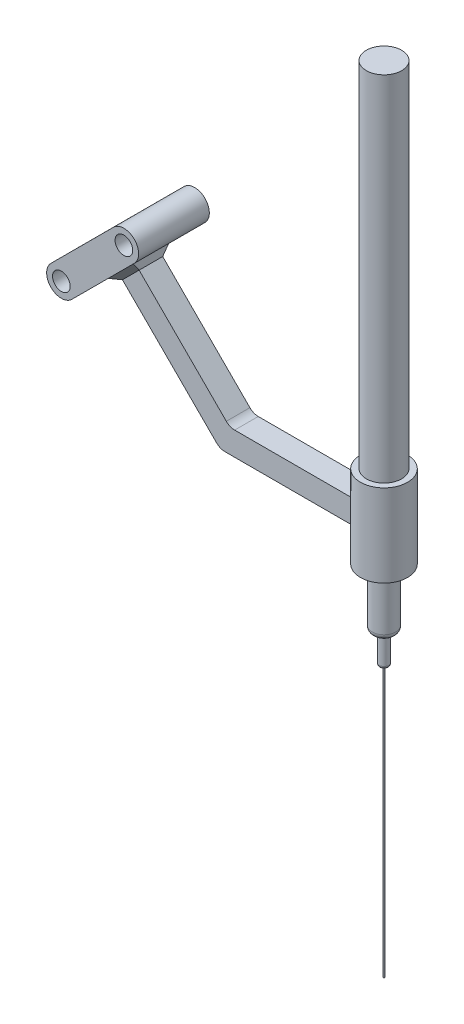
ISO-10303-21;
HEADER;
FILE_DESCRIPTION(('STEP AP214'),'2;1');
FILE_NAME('part.step','',(''),(''),'','','');
FILE_SCHEMA(('AUTOMOTIVE_DESIGN { 1 0 10303 214 1 1 1 1 }'));
ENDSEC;
DATA;
#1=APPLICATION_CONTEXT('core data for automotive mechanical design processes');
#2=APPLICATION_PROTOCOL_DEFINITION('international standard','automotive_design',2000,#1);
#3=PRODUCT_CONTEXT('',#1,'mechanical');
#4=PRODUCT('Part','Part','',(#3));
#5=PRODUCT_RELATED_PRODUCT_CATEGORY('part','',(#4));
#6=PRODUCT_DEFINITION_FORMATION('','',#4);
#7=PRODUCT_DEFINITION_CONTEXT('part definition',#1,'design');
#8=PRODUCT_DEFINITION('design','',#6,#7);
#9=PRODUCT_DEFINITION_SHAPE('','',#8);
#10=(LENGTH_UNIT() NAMED_UNIT(*) SI_UNIT(.MILLI.,.METRE.));
#11=(NAMED_UNIT(*) PLANE_ANGLE_UNIT() SI_UNIT($,.RADIAN.));
#12=(NAMED_UNIT(*) SI_UNIT($,.STERADIAN.) SOLID_ANGLE_UNIT());
#13=UNCERTAINTY_MEASURE_WITH_UNIT(LENGTH_MEASURE(1.E-05),#10,'distance_accuracy_value','');
#14=(GEOMETRIC_REPRESENTATION_CONTEXT(3) GLOBAL_UNCERTAINTY_ASSIGNED_CONTEXT((#13)) GLOBAL_UNIT_ASSIGNED_CONTEXT((#10,
#11,#12)) REPRESENTATION_CONTEXT('',''));
#15=CARTESIAN_POINT('',(0.,0.,0.));
#16=DIRECTION('',(0.,0.,1.));
#17=DIRECTION('',(1.,0.,0.));
#18=AXIS2_PLACEMENT_3D('',#15,#16,#17);
#19=CARTESIAN_POINT('',(84.9348889540142,25.7599169859285,6.));
#20=DIRECTION('',(0.,0.,1.));
#21=DIRECTION('',(0.941950963525003,-0.335750476268192,0.));
#22=AXIS2_PLACEMENT_3D('',#19,#20,#21);
#23=PLANE('',#22);
#24=CARTESIAN_POINT('',(84.9348889540142,25.7599169859285,6.));
#25=DIRECTION('',(0.,0.,1.));
#26=DIRECTION('',(0.941950963525003,-0.335750476268192,0.));
#27=AXIS2_PLACEMENT_3D('',#24,#25,#26);
#28=CIRCLE('',#27,1.5);
#29=CARTESIAN_POINT('',(86.3478153993017,25.2562912715262,6.));
#30=VERTEX_POINT('',#29);
#31=EDGE_CURVE('E201',#30,#30,#28,.T.);
#32=ORIENTED_EDGE('',*,*,#31,.F.);
#33=EDGE_LOOP('',(#32));
#34=FACE_BOUND('',#33,.T.);
#35=CARTESIAN_POINT('',(84.9348889540142,25.7599169859285,6.));
#36=DIRECTION('',(0.,0.,1.));
#37=DIRECTION('',(0.941950963525003,-0.335750476268192,0.));
#38=AXIS2_PLACEMENT_3D('',#35,#36,#37);
#39=CIRCLE('',#38,2.50000000000002);
#40=CARTESIAN_POINT('',(86.7020387322198,23.9915330735984,6.));
#41=VERTEX_POINT('',#40);
#42=CARTESIAN_POINT('',(83.1677391758085,27.5283008982586,6.));
#43=VERTEX_POINT('',#42);
#44=EDGE_CURVE('E207',#41,#43,#39,.T.);
#45=ORIENTED_EDGE('',*,*,#44,.T.);
#46=DIRECTION('',(-0.707353564932031,-0.706859911282248,0.));
#47=VECTOR('',#46,1.);
#48=CARTESIAN_POINT('',(83.1677391758085,27.5283008982586,6.));
#49=LINE('',#48,#47);
#50=CARTESIAN_POINT('',(72.5574357018281,16.9254022290249,6.));
#51=VERTEX_POINT('',#50);
#52=EDGE_CURVE('E210',#43,#51,#49,.T.);
#53=ORIENTED_EDGE('',*,*,#52,.T.);
#54=CARTESIAN_POINT('',(74.3245854800337,15.1570183166948,6.));
#55=DIRECTION('',(0.,0.,1.));
#56=DIRECTION('',(0.941950963525003,-0.335750476268192,0.));
#57=AXIS2_PLACEMENT_3D('',#54,#55,#56);
#58=CIRCLE('',#57,2.50000000000002);
#59=CARTESIAN_POINT('',(76.0917352582394,13.3886344043647,6.));
#60=VERTEX_POINT('',#59);
#61=EDGE_CURVE('E213',#51,#60,#58,.T.);
#62=ORIENTED_EDGE('',*,*,#61,.T.);
#63=DIRECTION('',(0.707353564932031,0.706859911282248,0.));
#64=VECTOR('',#63,1.);
#65=CARTESIAN_POINT('',(86.7020387322198,23.9915330735984,6.));
#66=LINE('',#65,#64);
#67=EDGE_CURVE('E215',#60,#41,#66,.T.);
#68=ORIENTED_EDGE('',*,*,#67,.T.);
#69=EDGE_LOOP('',(#45,#53,#62,#68));
#70=FACE_BOUND('',#69,.T.);
#71=CARTESIAN_POINT('',(74.3245854800337,15.1570183166948,6.));
#72=DIRECTION('',(0.,0.,1.));
#73=DIRECTION('',(0.941950963525003,-0.335750476268192,0.));
#74=AXIS2_PLACEMENT_3D('',#71,#72,#73);
#75=CIRCLE('',#74,1.5);
#76=CARTESIAN_POINT('',(75.7375119253212,14.6533926022925,6.));
#77=VERTEX_POINT('',#76);
#78=EDGE_CURVE('E195',#77,#77,#75,.T.);
#79=ORIENTED_EDGE('',*,*,#78,.F.);
#80=EDGE_LOOP('',(#79));
#81=FACE_BOUND('',#80,.T.);
#82=ADVANCED_FACE('F44',(#34,#70,#81),#23,.T.);
#83=CARTESIAN_POINT('',(84.9348889540142,25.7599169859285,-6.));
#84=DIRECTION('',(0.,0.,1.));
#85=DIRECTION('',(0.941950963525003,-0.335750476268192,0.));
#86=AXIS2_PLACEMENT_3D('',#83,#84,#85);
#87=PLANE('',#86);
#88=CARTESIAN_POINT('',(84.9348889540142,25.7599169859285,-6.));
#89=DIRECTION('',(0.,0.,1.));
#90=DIRECTION('',(0.941950963525003,-0.335750476268192,0.));
#91=AXIS2_PLACEMENT_3D('',#88,#89,#90);
#92=CIRCLE('',#91,2.50000000000002);
#93=CARTESIAN_POINT('',(86.7020387322198,23.9915330735984,-6.));
#94=VERTEX_POINT('',#93);
#95=CARTESIAN_POINT('',(83.1677391758085,27.5283008982586,-6.));
#96=VERTEX_POINT('',#95);
#97=EDGE_CURVE('E204',#94,#96,#92,.T.);
#98=ORIENTED_EDGE('',*,*,#97,.F.);
#99=DIRECTION('',(0.707353564932031,0.706859911282248,0.));
#100=VECTOR('',#99,1.);
#101=CARTESIAN_POINT('',(86.7020387322198,23.9915330735984,-6.));
#102=LINE('',#101,#100);
#103=CARTESIAN_POINT('',(76.0917352582394,13.3886344043647,-6.));
#104=VERTEX_POINT('',#103);
#105=EDGE_CURVE('E211',#104,#94,#102,.T.);
#106=ORIENTED_EDGE('',*,*,#105,.F.);
#107=CARTESIAN_POINT('',(74.3245854800337,15.1570183166948,-6.));
#108=DIRECTION('',(0.,0.,1.));
#109=DIRECTION('',(0.941950963525003,-0.335750476268192,0.));
#110=AXIS2_PLACEMENT_3D('',#107,#108,#109);
#111=CIRCLE('',#110,2.50000000000002);
#112=CARTESIAN_POINT('',(72.5574357018281,16.9254022290249,-6.));
#113=VERTEX_POINT('',#112);
#114=EDGE_CURVE('E222',#113,#104,#111,.T.);
#115=ORIENTED_EDGE('',*,*,#114,.F.);
#116=DIRECTION('',(-0.707353564932031,-0.706859911282248,0.));
#117=VECTOR('',#116,1.);
#118=CARTESIAN_POINT('',(83.1677391758085,27.5283008982586,-6.));
#119=LINE('',#118,#117);
#120=EDGE_CURVE('E220',#96,#113,#119,.T.);
#121=ORIENTED_EDGE('',*,*,#120,.F.);
#122=EDGE_LOOP('',(#98,#106,#115,#121));
#123=FACE_BOUND('',#122,.T.);
#124=CARTESIAN_POINT('',(84.9348889540142,25.7599169859285,-6.));
#125=DIRECTION('',(0.,0.,1.));
#126=DIRECTION('',(0.941950963525003,-0.335750476268192,0.));
#127=AXIS2_PLACEMENT_3D('',#124,#125,#126);
#128=CIRCLE('',#127,1.5);
#129=CARTESIAN_POINT('',(86.3478153993017,25.2562912715262,-6.));
#130=VERTEX_POINT('',#129);
#131=EDGE_CURVE('E198',#130,#130,#128,.T.);
#132=ORIENTED_EDGE('',*,*,#131,.T.);
#133=EDGE_LOOP('',(#132));
#134=FACE_BOUND('',#133,.T.);
#135=CARTESIAN_POINT('',(74.3245854800337,15.1570183166948,-6.));
#136=DIRECTION('',(0.,0.,1.));
#137=DIRECTION('',(0.941950963525003,-0.335750476268192,0.));
#138=AXIS2_PLACEMENT_3D('',#135,#136,#137);
#139=CIRCLE('',#138,1.5);
#140=CARTESIAN_POINT('',(75.7375119253212,14.6533926022925,-6.));
#141=VERTEX_POINT('',#140);
#142=EDGE_CURVE('E194',#141,#141,#139,.T.);
#143=ORIENTED_EDGE('',*,*,#142,.T.);
#144=EDGE_LOOP('',(#143));
#145=FACE_BOUND('',#144,.T.);
#146=ADVANCED_FACE('F346',(#123,#134,#145),#87,.F.);
#147=CARTESIAN_POINT('',(84.9348889540142,25.7599169859285,6.));
#148=DIRECTION('',(0.,0.,-1.));
#149=DIRECTION('',(-0.941950963525003,0.335750476268192,0.));
#150=AXIS2_PLACEMENT_3D('',#147,#148,#149);
#151=CYLINDRICAL_SURFACE('',#150,2.50000000000002);
#152=ORIENTED_EDGE('',*,*,#97,.T.);
#153=DIRECTION('',(0.,0.,-1.));
#154=VECTOR('',#153,1.);
#155=CARTESIAN_POINT('',(83.1677391758085,27.5283008982586,6.));
#156=LINE('',#155,#154);
#157=EDGE_CURVE('E160',#43,#96,#156,.T.);
#158=ORIENTED_EDGE('',*,*,#157,.F.);
#159=ORIENTED_EDGE('',*,*,#44,.F.);
#160=DIRECTION('',(0.,0.,-1.));
#161=VECTOR('',#160,1.);
#162=CARTESIAN_POINT('',(86.7020387322198,23.9915330735984,6.));
#163=LINE('',#162,#161);
#164=EDGE_CURVE('E217',#41,#94,#163,.T.);
#165=ORIENTED_EDGE('',*,*,#164,.T.);
#166=EDGE_LOOP('',(#152,#158,#159,#165));
#167=FACE_BOUND('',#166,.T.);
#168=ADVANCED_FACE('F352',(#167),#151,.T.);
#169=CARTESIAN_POINT('',(83.1677391758085,27.5283008982586,6.));
#170=DIRECTION('',(0.706859911282248,-0.707353564932031,0.));
#171=DIRECTION('',(0.707353564932031,0.706859911282248,0.));
#172=AXIS2_PLACEMENT_3D('',#169,#170,#171);
#173=PLANE('',#172);
#174=ORIENTED_EDGE('',*,*,#120,.T.);
#175=DIRECTION('',(0.,0.,-1.));
#176=VECTOR('',#175,1.);
#177=CARTESIAN_POINT('',(72.5574357018281,16.9254022290249,6.));
#178=LINE('',#177,#176);
#179=EDGE_CURVE('E230',#51,#113,#178,.T.);
#180=ORIENTED_EDGE('',*,*,#179,.F.);
#181=ORIENTED_EDGE('',*,*,#52,.F.);
#182=ORIENTED_EDGE('',*,*,#157,.T.);
#183=EDGE_LOOP('',(#174,#180,#181,#182));
#184=FACE_BOUND('',#183,.T.);
#185=ADVANCED_FACE('F368',(#184),#173,.F.);
#186=CARTESIAN_POINT('',(74.3245854800337,15.1570183166948,6.));
#187=DIRECTION('',(0.,0.,-1.));
#188=DIRECTION('',(-0.941950963525003,0.335750476268192,0.));
#189=AXIS2_PLACEMENT_3D('',#186,#187,#188);
#190=CYLINDRICAL_SURFACE('',#189,2.50000000000002);
#191=ORIENTED_EDGE('',*,*,#114,.T.);
#192=DIRECTION('',(0.,0.,-1.));
#193=VECTOR('',#192,1.);
#194=CARTESIAN_POINT('',(76.0917352582394,13.3886344043647,6.));
#195=LINE('',#194,#193);
#196=EDGE_CURVE('E227',#60,#104,#195,.T.);
#197=ORIENTED_EDGE('',*,*,#196,.F.);
#198=ORIENTED_EDGE('',*,*,#61,.F.);
#199=ORIENTED_EDGE('',*,*,#179,.T.);
#200=EDGE_LOOP('',(#191,#197,#198,#199));
#201=FACE_BOUND('',#200,.T.);
#202=ADVANCED_FACE('F364',(#201),#190,.T.);
#203=CARTESIAN_POINT('',(86.7020387322198,23.9915330735984,6.));
#204=DIRECTION('',(-0.706859911282248,0.707353564932031,0.));
#205=DIRECTION('',(-0.707353564932031,-0.706859911282248,0.));
#206=AXIS2_PLACEMENT_3D('',#203,#204,#205);
#207=PLANE('',#206);
#208=DIRECTION('',(-0.707353564932031,-0.706859911282248,0.));
#209=VECTOR('',#208,1.);
#210=CARTESIAN_POINT('',(79.9821798653655,17.2763639164171,-2.99999999999997));
#211=LINE('',#210,#209);
#212=CARTESIAN_POINT('',(83.5189476900257,20.8106634728283,-2.99999999999997));
#213=VERTEX_POINT('',#212);
#214=CARTESIAN_POINT('',(79.2748263004335,16.5695040051348,-2.99999999999997));
#215=VERTEX_POINT('',#214);
#216=EDGE_CURVE('E253',#213,#215,#211,.T.);
#217=ORIENTED_EDGE('',*,*,#216,.T.);
#218=DIRECTION('',(0.,0.,1.));
#219=VECTOR('',#218,1.);
#220=CARTESIAN_POINT('',(79.2748263004335,16.5695040051348,2.));
#221=LINE('',#220,#219);
#222=CARTESIAN_POINT('',(79.2748263004335,16.5695040051348,2.99999999999997));
#223=VERTEX_POINT('',#222);
#224=EDGE_CURVE('E255',#215,#223,#221,.T.);
#225=ORIENTED_EDGE('',*,*,#224,.T.);
#226=DIRECTION('',(0.707353564932031,0.706859911282248,0.));
#227=VECTOR('',#226,1.);
#228=CARTESIAN_POINT('',(86.7020387322198,23.9915330735984,2.99999999999997));
#229=LINE('',#228,#227);
#230=CARTESIAN_POINT('',(83.5189476900257,20.8106634728283,2.99999999999997));
#231=VERTEX_POINT('',#230);
#232=EDGE_CURVE('E249',#223,#231,#229,.T.);
#233=ORIENTED_EDGE('',*,*,#232,.T.);
#234=DIRECTION('',(0.,0.,-1.));
#235=VECTOR('',#234,1.);
#236=CARTESIAN_POINT('',(83.5189476900257,20.8106634728283,-2.));
#237=LINE('',#236,#235);
#238=EDGE_CURVE('E251',#231,#213,#237,.T.);
#239=ORIENTED_EDGE('',*,*,#238,.T.);
#240=EDGE_LOOP('',(#217,#225,#233,#239));
#241=FACE_BOUND('',#240,.T.);
#242=ORIENTED_EDGE('',*,*,#105,.T.);
#243=ORIENTED_EDGE('',*,*,#164,.F.);
#244=ORIENTED_EDGE('',*,*,#67,.F.);
#245=ORIENTED_EDGE('',*,*,#196,.T.);
#246=EDGE_LOOP('',(#242,#243,#244,#245));
#247=FACE_BOUND('',#246,.T.);
#248=ADVANCED_FACE('F361',(#241,#247),#207,.F.);
#249=CARTESIAN_POINT('',(84.9348889540142,25.7599169859285,6.));
#250=DIRECTION('',(0.,0.,-1.));
#251=DIRECTION('',(-0.941950963525003,0.335750476268192,0.));
#252=AXIS2_PLACEMENT_3D('',#249,#250,#251);
#253=CYLINDRICAL_SURFACE('',#252,1.5);
#254=ORIENTED_EDGE('',*,*,#31,.T.);
#255=EDGE_LOOP('',(#254));
#256=FACE_BOUND('',#255,.T.);
#257=ORIENTED_EDGE('',*,*,#131,.F.);
#258=EDGE_LOOP('',(#257));
#259=FACE_BOUND('',#258,.T.);
#260=ADVANCED_FACE('F358',(#256,#259),#253,.F.);
#261=CARTESIAN_POINT('',(74.3245854800337,15.1570183166948,6.));
#262=DIRECTION('',(0.,0.,-1.));
#263=DIRECTION('',(-0.941950963525003,0.335750476268192,0.));
#264=AXIS2_PLACEMENT_3D('',#261,#262,#263);
#265=CYLINDRICAL_SURFACE('',#264,1.5);
#266=ORIENTED_EDGE('',*,*,#78,.T.);
#267=EDGE_LOOP('',(#266));
#268=FACE_BOUND('',#267,.T.);
#269=ORIENTED_EDGE('',*,*,#142,.F.);
#270=EDGE_LOOP('',(#269));
#271=FACE_BOUND('',#270,.T.);
#272=ADVANCED_FACE('F464',(#268,#271),#265,.F.);
#273=CARTESIAN_POINT('',(82.8115941250937,20.103803561546,2.));
#274=DIRECTION('',(-0.707353564932032,-0.706859911282246,0.));
#275=DIRECTION('',(0.706859911282246,-0.707353564932032,0.));
#276=AXIS2_PLACEMENT_3D('',#273,#274,#275);
#277=PLANE('',#276);
#278=DIRECTION('',(-0.706859911282246,0.707353564932032,0.));
#279=VECTOR('',#278,1.);
#280=CARTESIAN_POINT('',(82.8115941250937,20.103803561546,-2.));
#281=LINE('',#280,#279);
#282=CARTESIAN_POINT('',(98.3182880139787,4.58628017743554,-2.));
#283=VERTEX_POINT('',#282);
#284=CARTESIAN_POINT('',(83.5184540363759,19.396449996614,-2.));
#285=VERTEX_POINT('',#284);
#286=EDGE_CURVE('E302',#283,#285,#281,.T.);
#287=ORIENTED_EDGE('',*,*,#286,.T.);
#288=DIRECTION('',(0.,0.,1.));
#289=VECTOR('',#288,1.);
#290=CARTESIAN_POINT('',(83.5184540363759,19.396449996614,2.));
#291=LINE('',#290,#289);
#292=CARTESIAN_POINT('',(83.5184540363759,19.396449996614,2.));
#293=VERTEX_POINT('',#292);
#294=EDGE_CURVE('E54',#285,#293,#291,.T.);
#295=ORIENTED_EDGE('',*,*,#294,.T.);
#296=DIRECTION('',(-0.706859911282246,0.707353564932032,0.));
#297=VECTOR('',#296,1.);
#298=CARTESIAN_POINT('',(82.8115941250937,20.103803561546,2.));
#299=LINE('',#298,#297);
#300=CARTESIAN_POINT('',(98.3182880139787,4.58628017743554,2.));
#301=VERTEX_POINT('',#300);
#302=EDGE_CURVE('E176',#301,#293,#299,.T.);
#303=ORIENTED_EDGE('',*,*,#302,.F.);
#304=DIRECTION('',(0.,0.,-1.));
#305=VECTOR('',#304,1.);
#306=CARTESIAN_POINT('',(98.3182880139787,4.58628017743554,2.));
#307=LINE('',#306,#305);
#308=EDGE_CURVE('E182',#301,#283,#307,.T.);
#309=ORIENTED_EDGE('',*,*,#308,.T.);
#310=EDGE_LOOP('',(#287,#295,#303,#309));
#311=FACE_BOUND('',#310,.T.);
#312=ADVANCED_FACE('F462',(#311),#277,.F.);
#313=CARTESIAN_POINT('',(79.9821798653655,17.2763639164171,2.));
#314=DIRECTION('',(0.707353564932032,0.706859911282247,0.));
#315=DIRECTION('',(-0.706859911282247,0.707353564932032,0.));
#316=AXIS2_PLACEMENT_3D('',#313,#314,#315);
#317=PLANE('',#316);
#318=DIRECTION('',(0.706859911282247,-0.707353564932032,0.));
#319=VECTOR('',#318,1.);
#320=CARTESIAN_POINT('',(79.9821798653655,17.2763639164171,2.));
#321=LINE('',#320,#319);
#322=CARTESIAN_POINT('',(80.6890397766478,16.5690103514851,2.));
#323=VERTEX_POINT('',#322);
#324=CARTESIAN_POINT('',(96.6606157931796,0.586280177435512,2.));
#325=VERTEX_POINT('',#324);
#326=EDGE_CURVE('E304',#323,#325,#321,.T.);
#327=ORIENTED_EDGE('',*,*,#326,.F.);
#328=DIRECTION('',(0.,0.,-1.));
#329=VECTOR('',#328,1.);
#330=CARTESIAN_POINT('',(80.6890397766477,16.569010351485,-2.));
#331=LINE('',#330,#329);
#332=CARTESIAN_POINT('',(80.6890397766477,16.5690103514851,-2.));
#333=VERTEX_POINT('',#332);
#334=EDGE_CURVE('E246',#323,#333,#331,.T.);
#335=ORIENTED_EDGE('',*,*,#334,.T.);
#336=DIRECTION('',(0.706859911282247,-0.707353564932032,0.));
#337=VECTOR('',#336,1.);
#338=CARTESIAN_POINT('',(79.9821798653655,17.2763639164171,-2.));
#339=LINE('',#338,#337);
#340=CARTESIAN_POINT('',(96.6606157931796,0.586280177435512,-2.));
#341=VERTEX_POINT('',#340);
#342=EDGE_CURVE('E314',#333,#341,#339,.T.);
#343=ORIENTED_EDGE('',*,*,#342,.T.);
#344=DIRECTION('',(0.,0.,-1.));
#345=VECTOR('',#344,1.);
#346=CARTESIAN_POINT('',(96.6606157931796,0.586280177435512,2.));
#347=LINE('',#346,#345);
#348=EDGE_CURVE('E191',#325,#341,#347,.T.);
#349=ORIENTED_EDGE('',*,*,#348,.F.);
#350=EDGE_LOOP('',(#327,#335,#343,#349));
#351=FACE_BOUND('',#350,.T.);
#352=ADVANCED_FACE('F329',(#351),#317,.F.);
#353=CARTESIAN_POINT('',(98.0753229230438,2.00000000000001,2.));
#354=DIRECTION('',(0.,0.,-1.));
#355=DIRECTION('',(-0.941950963525003,0.335750476268192,0.));
#356=AXIS2_PLACEMENT_3D('',#353,#354,#355);
#357=CYLINDRICAL_SURFACE('',#356,2.00000000000005);
#358=CARTESIAN_POINT('',(98.0753229230438,2.00000000000001,-2.));
#359=DIRECTION('',(0.,0.,1.));
#360=DIRECTION('',(0.941950963525003,-0.335750476268192,0.));
#361=AXIS2_PLACEMENT_3D('',#358,#359,#360);
#362=CIRCLE('',#361,2.00000000000005);
#363=CARTESIAN_POINT('',(98.0753229230437,0.,-2.));
#364=VERTEX_POINT('',#363);
#365=EDGE_CURVE('E178',#341,#364,#362,.T.);
#366=ORIENTED_EDGE('',*,*,#365,.T.);
#367=DIRECTION('',(0.,0.,-1.));
#368=VECTOR('',#367,1.);
#369=CARTESIAN_POINT('',(98.0753229230437,0.,2.));
#370=LINE('',#369,#368);
#371=CARTESIAN_POINT('',(98.0753229230437,0.,2.));
#372=VERTEX_POINT('',#371);
#373=EDGE_CURVE('E188',#372,#364,#370,.T.);
#374=ORIENTED_EDGE('',*,*,#373,.F.);
#375=CARTESIAN_POINT('',(98.0753229230438,2.00000000000001,2.));
#376=DIRECTION('',(0.,0.,1.));
#377=DIRECTION('',(0.941950963525003,-0.335750476268192,0.));
#378=AXIS2_PLACEMENT_3D('',#375,#376,#377);
#379=CIRCLE('',#378,2.00000000000005);
#380=EDGE_CURVE('E306',#325,#372,#379,.T.);
#381=ORIENTED_EDGE('',*,*,#380,.F.);
#382=ORIENTED_EDGE('',*,*,#348,.T.);
#383=EDGE_LOOP('',(#366,#374,#381,#382));
#384=FACE_BOUND('',#383,.T.);
#385=ADVANCED_FACE('F318',(#384),#357,.T.);
#386=CARTESIAN_POINT('',(123.075322923044,0.,2.));
#387=DIRECTION('',(0.,1.,0.));
#388=DIRECTION('',(-1.,0.,0.));
#389=AXIS2_PLACEMENT_3D('',#386,#387,#388);
#390=PLANE('',#389);
#391=DIRECTION('',(1.,0.,0.));
#392=VECTOR('',#391,1.);
#393=CARTESIAN_POINT('',(123.075322923044,0.,-2.));
#394=LINE('',#393,#392);
#395=CARTESIAN_POINT('',(119.611221307906,0.,-2.));
#396=VERTEX_POINT('',#395);
#397=EDGE_CURVE('E174',#364,#396,#394,.T.);
#398=ORIENTED_EDGE('',*,*,#397,.T.);
#399=CARTESIAN_POINT('',(123.075322923044,0.,0.));
#400=DIRECTION('',(0.,1.,0.));
#401=DIRECTION('',(-1.,0.,0.));
#402=AXIS2_PLACEMENT_3D('',#399,#400,#401);
#403=CIRCLE('',#402,3.99999999999996);
#404=CARTESIAN_POINT('',(119.611221307906,0.,2.));
#405=VERTEX_POINT('',#404);
#406=EDGE_CURVE('E155',#396,#405,#403,.T.);
#407=ORIENTED_EDGE('',*,*,#406,.T.);
#408=DIRECTION('',(1.,0.,0.));
#409=VECTOR('',#408,1.);
#410=CARTESIAN_POINT('',(123.075322923044,0.,2.));
#411=LINE('',#410,#409);
#412=EDGE_CURVE('E308',#372,#405,#411,.T.);
#413=ORIENTED_EDGE('',*,*,#412,.F.);
#414=ORIENTED_EDGE('',*,*,#373,.T.);
#415=EDGE_LOOP('',(#398,#407,#413,#414));
#416=FACE_BOUND('',#415,.T.);
#417=ADVANCED_FACE('F323',(#416),#390,.F.);
#418=CARTESIAN_POINT('',(123.075322923044,4.00000000000001,2.));
#419=DIRECTION('',(0.,-1.,0.));
#420=DIRECTION('',(1.,0.,0.));
#421=AXIS2_PLACEMENT_3D('',#418,#419,#420);
#422=PLANE('',#421);
#423=DIRECTION('',(-1.,0.,0.));
#424=VECTOR('',#423,1.);
#425=CARTESIAN_POINT('',(123.075322923044,4.00000000000001,2.));
#426=LINE('',#425,#424);
#427=CARTESIAN_POINT('',(119.611221307906,4.00000000000001,2.));
#428=VERTEX_POINT('',#427);
#429=CARTESIAN_POINT('',(99.7329951438427,4.,2.));
#430=VERTEX_POINT('',#429);
#431=EDGE_CURVE('E168',#428,#430,#426,.T.);
#432=ORIENTED_EDGE('',*,*,#431,.F.);
#433=CARTESIAN_POINT('',(123.075322923044,4.00000000000001,0.));
#434=DIRECTION('',(0.,-1.,0.));
#435=DIRECTION('',(1.,0.,0.));
#436=AXIS2_PLACEMENT_3D('',#433,#434,#435);
#437=CIRCLE('',#436,3.99999999999996);
#438=CARTESIAN_POINT('',(119.611221307906,4.00000000000001,-2.));
#439=VERTEX_POINT('',#438);
#440=EDGE_CURVE('E152',#428,#439,#437,.T.);
#441=ORIENTED_EDGE('',*,*,#440,.T.);
#442=DIRECTION('',(-1.,0.,0.));
#443=VECTOR('',#442,1.);
#444=CARTESIAN_POINT('',(123.075322923044,4.00000000000001,-2.));
#445=LINE('',#444,#443);
#446=CARTESIAN_POINT('',(99.7329951438427,4.,-2.));
#447=VERTEX_POINT('',#446);
#448=EDGE_CURVE('E166',#439,#447,#445,.T.);
#449=ORIENTED_EDGE('',*,*,#448,.T.);
#450=DIRECTION('',(0.,0.,-1.));
#451=VECTOR('',#450,1.);
#452=CARTESIAN_POINT('',(99.7329951438427,4.,2.));
#453=LINE('',#452,#451);
#454=EDGE_CURVE('E185',#430,#447,#453,.T.);
#455=ORIENTED_EDGE('',*,*,#454,.F.);
#456=EDGE_LOOP('',(#432,#441,#449,#455));
#457=FACE_BOUND('',#456,.T.);
#458=ADVANCED_FACE('F164',(#457),#422,.F.);
#459=CARTESIAN_POINT('',(99.7329951438428,6.00000000000001,2.));
#460=DIRECTION('',(0.,0.,-1.));
#461=DIRECTION('',(-0.941950963525003,0.335750476268192,0.));
#462=AXIS2_PLACEMENT_3D('',#459,#460,#461);
#463=CYLINDRICAL_SURFACE('',#462,2.00000000000005);
#464=CARTESIAN_POINT('',(99.7329951438428,6.00000000000001,-2.));
#465=DIRECTION('',(0.,0.,-1.));
#466=DIRECTION('',(0.941950963525003,-0.335750476268192,0.));
#467=AXIS2_PLACEMENT_3D('',#464,#465,#466);
#468=CIRCLE('',#467,2.00000000000005);
#469=EDGE_CURVE('E173',#447,#283,#468,.T.);
#470=ORIENTED_EDGE('',*,*,#469,.T.);
#471=ORIENTED_EDGE('',*,*,#308,.F.);
#472=CARTESIAN_POINT('',(99.7329951438428,6.00000000000001,2.));
#473=DIRECTION('',(0.,0.,-1.));
#474=DIRECTION('',(0.941950963525003,-0.335750476268192,0.));
#475=AXIS2_PLACEMENT_3D('',#472,#473,#474);
#476=CIRCLE('',#475,2.00000000000005);
#477=EDGE_CURVE('E186',#430,#301,#476,.T.);
#478=ORIENTED_EDGE('',*,*,#477,.F.);
#479=ORIENTED_EDGE('',*,*,#454,.T.);
#480=EDGE_LOOP('',(#470,#471,#478,#479));
#481=FACE_BOUND('',#480,.T.);
#482=ADVANCED_FACE('F448',(#481),#463,.F.);
#483=CARTESIAN_POINT('',(99.7329951438428,6.00000000000001,2.));
#484=DIRECTION('',(0.,0.,1.));
#485=DIRECTION('',(0.941950963525003,-0.335750476268192,0.));
#486=AXIS2_PLACEMENT_3D('',#483,#484,#485);
#487=PLANE('',#486);
#488=ORIENTED_EDGE('',*,*,#302,.T.);
#489=DIRECTION('',(-0.707353564932031,-0.706859911282248,0.));
#490=VECTOR('',#489,1.);
#491=CARTESIAN_POINT('',(84.93316116624,20.8101698191786,2.));
#492=LINE('',#491,#490);
#493=EDGE_CURVE('E12',#293,#323,#492,.T.);
#494=ORIENTED_EDGE('',*,*,#493,.T.);
#495=ORIENTED_EDGE('',*,*,#326,.T.);
#496=ORIENTED_EDGE('',*,*,#380,.T.);
#497=ORIENTED_EDGE('',*,*,#412,.T.);
#498=DIRECTION('',(0.,1.,0.));
#499=VECTOR('',#498,1.);
#500=CARTESIAN_POINT('',(119.611221307906,-21.3137084989847,2.));
#501=LINE('',#500,#499);
#502=EDGE_CURVE('E300',#428,#405,#501,.F.);
#503=ORIENTED_EDGE('',*,*,#502,.F.);
#504=ORIENTED_EDGE('',*,*,#431,.T.);
#505=ORIENTED_EDGE('',*,*,#477,.T.);
#506=EDGE_LOOP('',(#488,#494,#495,#496,#497,#503,#504,#505));
#507=FACE_BOUND('',#506,.T.);
#508=ADVANCED_FACE('F325',(#507),#487,.T.);
#509=CARTESIAN_POINT('',(99.7329951438428,6.00000000000001,-2.));
#510=DIRECTION('',(0.,0.,1.));
#511=DIRECTION('',(0.941950963525003,-0.335750476268192,0.));
#512=AXIS2_PLACEMENT_3D('',#509,#510,#511);
#513=PLANE('',#512);
#514=ORIENTED_EDGE('',*,*,#342,.F.);
#515=DIRECTION('',(0.707353564932031,0.706859911282248,0.));
#516=VECTOR('',#515,1.);
#517=CARTESIAN_POINT('',(83.5184540363759,19.3964499966141,-2.));
#518=LINE('',#517,#516);
#519=EDGE_CURVE('E69',#333,#285,#518,.T.);
#520=ORIENTED_EDGE('',*,*,#519,.T.);
#521=ORIENTED_EDGE('',*,*,#286,.F.);
#522=ORIENTED_EDGE('',*,*,#469,.F.);
#523=ORIENTED_EDGE('',*,*,#448,.F.);
#524=DIRECTION('',(0.,1.,0.));
#525=VECTOR('',#524,1.);
#526=CARTESIAN_POINT('',(119.611221307906,-21.3137084989847,-2.));
#527=LINE('',#526,#525);
#528=EDGE_CURVE('E148',#439,#396,#527,.F.);
#529=ORIENTED_EDGE('',*,*,#528,.T.);
#530=ORIENTED_EDGE('',*,*,#397,.F.);
#531=ORIENTED_EDGE('',*,*,#365,.F.);
#532=EDGE_LOOP('',(#514,#520,#521,#522,#523,#529,#530,#531));
#533=FACE_BOUND('',#532,.T.);
#534=ADVANCED_FACE('F172',(#533),#513,.F.);
#535=CARTESIAN_POINT('',(123.075322923044,-21.3137084989847,0.));
#536=DIRECTION('',(0.,1.,0.));
#537=DIRECTION('',(-1.,0.,0.));
#538=AXIS2_PLACEMENT_3D('',#535,#536,#537);
#539=CYLINDRICAL_SURFACE('',#538,3.99999999999996);
#540=ORIENTED_EDGE('',*,*,#440,.F.);
#541=ORIENTED_EDGE('',*,*,#502,.T.);
#542=ORIENTED_EDGE('',*,*,#406,.F.);
#543=ORIENTED_EDGE('',*,*,#528,.F.);
#544=EDGE_LOOP('',(#540,#541,#542,#543));
#545=FACE_BOUND('',#544,.T.);
#546=CARTESIAN_POINT('',(123.075322923044,-5.,0.));
#547=DIRECTION('',(0.,1.,0.));
#548=DIRECTION('',(-1.,0.,0.));
#549=AXIS2_PLACEMENT_3D('',#546,#547,#548);
#550=CIRCLE('',#549,3.99999999999996);
#551=CARTESIAN_POINT('',(119.075322923044,-5.,0.));
#552=VERTEX_POINT('',#551);
#553=EDGE_CURVE('E169',#552,#552,#550,.F.);
#554=ORIENTED_EDGE('',*,*,#553,.F.);
#555=EDGE_LOOP('',(#554));
#556=FACE_BOUND('',#555,.T.);
#557=CARTESIAN_POINT('',(123.075322923044,8.99999999999995,0.));
#558=DIRECTION('',(0.,1.,0.));
#559=DIRECTION('',(-1.,0.,0.));
#560=AXIS2_PLACEMENT_3D('',#557,#558,#559);
#561=CIRCLE('',#560,3.99999999999996);
#562=CARTESIAN_POINT('',(119.075322923044,8.99999999999995,0.));
#563=VERTEX_POINT('',#562);
#564=EDGE_CURVE('E294',#563,#563,#561,.T.);
#565=ORIENTED_EDGE('',*,*,#564,.F.);
#566=EDGE_LOOP('',(#565));
#567=FACE_BOUND('',#566,.T.);
#568=ADVANCED_FACE('F150',(#545,#556,#567),#539,.T.);
#569=CARTESIAN_POINT('',(123.075322923044,-5.,2.));
#570=DIRECTION('',(0.,1.,0.));
#571=DIRECTION('',(-1.,0.,0.));
#572=AXIS2_PLACEMENT_3D('',#569,#570,#571);
#573=PLANE('',#572);
#574=ORIENTED_EDGE('',*,*,#553,.T.);
#575=EDGE_LOOP('',(#574));
#576=FACE_BOUND('',#575,.T.);
#577=CARTESIAN_POINT('',(123.075322923044,-5.00000000000002,0.));
#578=DIRECTION('',(0.,1.,0.));
#579=DIRECTION('',(-1.,0.,0.));
#580=AXIS2_PLACEMENT_3D('',#577,#578,#579);
#581=CIRCLE('',#580,2.00000000000001);
#582=CARTESIAN_POINT('',(121.075322923044,-5.00000000000002,0.));
#583=VERTEX_POINT('',#582);
#584=EDGE_CURVE('E280',#583,#583,#581,.T.);
#585=ORIENTED_EDGE('',*,*,#584,.T.);
#586=EDGE_LOOP('',(#585));
#587=FACE_BOUND('',#586,.T.);
#588=ADVANCED_FACE('F439',(#576,#587),#573,.F.);
#589=CARTESIAN_POINT('',(123.075322923044,8.99999999999995,0.));
#590=DIRECTION('',(0.,1.,0.));
#591=DIRECTION('',(-1.,0.,0.));
#592=AXIS2_PLACEMENT_3D('',#589,#590,#591);
#593=PLANE('',#592);
#594=ORIENTED_EDGE('',*,*,#564,.T.);
#595=EDGE_LOOP('',(#594));
#596=FACE_BOUND('',#595,.T.);
#597=CARTESIAN_POINT('',(123.075322923044,8.99999999999995,0.));
#598=DIRECTION('',(0.,1.,0.));
#599=DIRECTION('',(-1.,0.,0.));
#600=AXIS2_PLACEMENT_3D('',#597,#598,#599);
#601=CIRCLE('',#600,3.00000000000001);
#602=CARTESIAN_POINT('',(120.075322923044,8.99999999999995,0.));
#603=VERTEX_POINT('',#602);
#604=EDGE_CURVE('E291',#603,#603,#601,.T.);
#605=ORIENTED_EDGE('',*,*,#604,.F.);
#606=EDGE_LOOP('',(#605));
#607=FACE_BOUND('',#606,.T.);
#608=ADVANCED_FACE('F429',(#596,#607),#593,.T.);
#609=CARTESIAN_POINT('',(120.075322923044,69.,0.));
#610=DIRECTION('',(0.,1.,0.));
#611=DIRECTION('',(-1.,0.,0.));
#612=AXIS2_PLACEMENT_3D('',#609,#610,#611);
#613=PLANE('',#612);
#614=CARTESIAN_POINT('',(123.075322923044,69.,0.));
#615=DIRECTION('',(0.,1.,0.));
#616=DIRECTION('',(-1.,0.,0.));
#617=AXIS2_PLACEMENT_3D('',#614,#615,#616);
#618=CIRCLE('',#617,2.99999999999998);
#619=CARTESIAN_POINT('',(120.075322923044,69.,0.));
#620=VERTEX_POINT('',#619);
#621=EDGE_CURVE('E285',#620,#620,#618,.T.);
#622=ORIENTED_EDGE('',*,*,#621,.T.);
#623=EDGE_LOOP('',(#622));
#624=FACE_BOUND('',#623,.T.);
#625=ADVANCED_FACE('F425',(#624),#613,.T.);
#626=CARTESIAN_POINT('',(123.075322923044,69.,0.));
#627=DIRECTION('',(0.,1.,0.));
#628=DIRECTION('',(-1.,0.,0.));
#629=AXIS2_PLACEMENT_3D('',#626,#627,#628);
#630=CYLINDRICAL_SURFACE('',#629,2.99999999999999);
#631=ORIENTED_EDGE('',*,*,#604,.T.);
#632=EDGE_LOOP('',(#631));
#633=FACE_BOUND('',#632,.T.);
#634=ORIENTED_EDGE('',*,*,#621,.F.);
#635=EDGE_LOOP('',(#634));
#636=FACE_BOUND('',#635,.T.);
#637=ADVANCED_FACE('F421',(#633,#636),#630,.T.);
#638=CARTESIAN_POINT('',(123.075322923044,69.,0.));
#639=DIRECTION('',(0.,1.,0.));
#640=DIRECTION('',(-1.,0.,0.));
#641=AXIS2_PLACEMENT_3D('',#638,#639,#640);
#642=CYLINDRICAL_SURFACE('',#641,0.100000000000016);
#643=CARTESIAN_POINT('',(123.075322923044,-65.785712664924,0.));
#644=DIRECTION('',(0.,1.,0.));
#645=DIRECTION('',(-1.,0.,0.));
#646=AXIS2_PLACEMENT_3D('',#643,#644,#645);
#647=CIRCLE('',#646,0.100000000000017);
#648=CARTESIAN_POINT('',(122.975322923044,-65.785712664924,0.));
#649=VERTEX_POINT('',#648);
#650=EDGE_CURVE('E288',#649,#649,#647,.T.);
#651=ORIENTED_EDGE('',*,*,#650,.T.);
#652=EDGE_LOOP('',(#651));
#653=FACE_BOUND('',#652,.T.);
#654=CARTESIAN_POINT('',(123.075322923044,-20.,0.));
#655=DIRECTION('',(0.,1.,0.));
#656=DIRECTION('',(-1.,0.,0.));
#657=AXIS2_PLACEMENT_3D('',#654,#655,#656);
#658=CIRCLE('',#657,0.10000000000002);
#659=CARTESIAN_POINT('',(122.975322923044,-20.,0.));
#660=VERTEX_POINT('',#659);
#661=EDGE_CURVE('E269',#660,#660,#658,.T.);
#662=ORIENTED_EDGE('',*,*,#661,.F.);
#663=EDGE_LOOP('',(#662));
#664=FACE_BOUND('',#663,.T.);
#665=ADVANCED_FACE('F424',(#653,#664),#642,.T.);
#666=CARTESIAN_POINT('',(122.975322923044,-65.785712664924,0.));
#667=DIRECTION('',(0.,-1.,0.));
#668=DIRECTION('',(1.,0.,0.));
#669=AXIS2_PLACEMENT_3D('',#666,#667,#668);
#670=PLANE('',#669);
#671=ORIENTED_EDGE('',*,*,#650,.F.);
#672=EDGE_LOOP('',(#671));
#673=FACE_BOUND('',#672,.T.);
#674=ADVANCED_FACE('F416',(#673),#670,.T.);
#675=CARTESIAN_POINT('',(123.075322923044,69.,0.));
#676=DIRECTION('',(0.,1.,0.));
#677=DIRECTION('',(-1.,0.,0.));
#678=AXIS2_PLACEMENT_3D('',#675,#676,#677);
#679=CYLINDRICAL_SURFACE('',#678,2.);
#680=CARTESIAN_POINT('',(123.075322923044,-14.,0.));
#681=DIRECTION('',(0.,-1.,0.));
#682=DIRECTION('',(1.,0.,0.));
#683=AXIS2_PLACEMENT_3D('',#680,#681,#682);
#684=CIRCLE('',#683,2.);
#685=CARTESIAN_POINT('',(125.075322923044,-14.,0.));
#686=VERTEX_POINT('',#685);
#687=EDGE_CURVE('E159',#686,#686,#684,.F.);
#688=ORIENTED_EDGE('',*,*,#687,.T.);
#689=EDGE_LOOP('',(#688));
#690=FACE_BOUND('',#689,.T.);
#691=ORIENTED_EDGE('',*,*,#584,.F.);
#692=EDGE_LOOP('',(#691));
#693=FACE_BOUND('',#692,.T.);
#694=ADVANCED_FACE('F410',(#690,#693),#679,.T.);
#695=CARTESIAN_POINT('',(121.075322923044,-15.,0.));
#696=DIRECTION('',(0.,-1.,0.));
#697=DIRECTION('',(1.,0.,0.));
#698=AXIS2_PLACEMENT_3D('',#695,#696,#697);
#699=PLANE('',#698);
#700=CARTESIAN_POINT('',(123.075322923044,-15.,0.));
#701=DIRECTION('',(0.,-1.,0.));
#702=DIRECTION('',(1.,0.,0.));
#703=AXIS2_PLACEMENT_3D('',#700,#701,#702);
#704=CIRCLE('',#703,1.);
#705=CARTESIAN_POINT('',(124.075322923044,-15.,0.));
#706=VERTEX_POINT('',#705);
#707=EDGE_CURVE('E237',#706,#706,#704,.T.);
#708=ORIENTED_EDGE('',*,*,#707,.T.);
#709=EDGE_LOOP('',(#708));
#710=FACE_BOUND('',#709,.T.);
#711=CARTESIAN_POINT('',(123.075322923044,-15.,0.));
#712=DIRECTION('',(0.,1.,0.));
#713=DIRECTION('',(-1.,0.,0.));
#714=AXIS2_PLACEMENT_3D('',#711,#712,#713);
#715=CIRCLE('',#714,0.800000000000023);
#716=CARTESIAN_POINT('',(122.275322923044,-15.,0.));
#717=VERTEX_POINT('',#716);
#718=EDGE_CURVE('E275',#717,#717,#715,.T.);
#719=ORIENTED_EDGE('',*,*,#718,.T.);
#720=EDGE_LOOP('',(#719));
#721=FACE_BOUND('',#720,.T.);
#722=ADVANCED_FACE('F405',(#710,#721),#699,.T.);
#723=CARTESIAN_POINT('',(123.075322923044,69.,0.));
#724=DIRECTION('',(0.,1.,0.));
#725=DIRECTION('',(-1.,0.,0.));
#726=AXIS2_PLACEMENT_3D('',#723,#724,#725);
#727=CYLINDRICAL_SURFACE('',#726,0.800000000000025);
#728=CARTESIAN_POINT('',(123.075322923044,-19.5,0.));
#729=DIRECTION('',(0.,-1.,0.));
#730=DIRECTION('',(1.,0.,0.));
#731=AXIS2_PLACEMENT_3D('',#728,#729,#730);
#732=CIRCLE('',#731,0.800000000000025);
#733=CARTESIAN_POINT('',(123.875322923044,-19.5,0.));
#734=VERTEX_POINT('',#733);
#735=EDGE_CURVE('E240',#734,#734,#732,.F.);
#736=ORIENTED_EDGE('',*,*,#735,.T.);
#737=EDGE_LOOP('',(#736));
#738=FACE_BOUND('',#737,.T.);
#739=ORIENTED_EDGE('',*,*,#718,.F.);
#740=EDGE_LOOP('',(#739));
#741=FACE_BOUND('',#740,.T.);
#742=ADVANCED_FACE('F402',(#738,#741),#727,.T.);
#743=CARTESIAN_POINT('',(122.275322923044,-20.,0.));
#744=DIRECTION('',(0.,-1.,0.));
#745=DIRECTION('',(1.,0.,0.));
#746=AXIS2_PLACEMENT_3D('',#743,#744,#745);
#747=PLANE('',#746);
#748=CARTESIAN_POINT('',(123.075322923044,-20.,0.));
#749=DIRECTION('',(0.,-1.,0.));
#750=DIRECTION('',(1.,0.,0.));
#751=AXIS2_PLACEMENT_3D('',#748,#749,#750);
#752=CIRCLE('',#751,0.300000000000026);
#753=CARTESIAN_POINT('',(123.375322923044,-20.,0.));
#754=VERTEX_POINT('',#753);
#755=EDGE_CURVE('E243',#754,#754,#752,.T.);
#756=ORIENTED_EDGE('',*,*,#755,.T.);
#757=EDGE_LOOP('',(#756));
#758=FACE_BOUND('',#757,.T.);
#759=ORIENTED_EDGE('',*,*,#661,.T.);
#760=EDGE_LOOP('',(#759));
#761=FACE_BOUND('',#760,.T.);
#762=ADVANCED_FACE('F380',(#758,#761),#747,.T.);
#763=CARTESIAN_POINT('',(123.075322923044,-14.,0.));
#764=DIRECTION('',(0.,-1.,0.));
#765=DIRECTION('',(1.,0.,0.));
#766=AXIS2_PLACEMENT_3D('',#763,#764,#765);
#767=DEGENERATE_TOROIDAL_SURFACE('',#766,1.,1.,.T.);
#768=ORIENTED_EDGE('',*,*,#707,.F.);
#769=EDGE_LOOP('',(#768));
#770=FACE_BOUND('',#769,.T.);
#771=ORIENTED_EDGE('',*,*,#687,.F.);
#772=EDGE_LOOP('',(#771));
#773=FACE_BOUND('',#772,.T.);
#774=ADVANCED_FACE('F376',(#770,#773),#767,.T.);
#775=CARTESIAN_POINT('',(123.075322923044,-19.5,0.));
#776=DIRECTION('',(0.,-1.,0.));
#777=DIRECTION('',(1.,0.,0.));
#778=AXIS2_PLACEMENT_3D('',#775,#776,#777);
#779=DEGENERATE_TOROIDAL_SURFACE('',#778,0.300000000000026,0.5,.T.);
#780=ORIENTED_EDGE('',*,*,#755,.F.);
#781=EDGE_LOOP('',(#780));
#782=FACE_BOUND('',#781,.T.);
#783=ORIENTED_EDGE('',*,*,#735,.F.);
#784=EDGE_LOOP('',(#783));
#785=FACE_BOUND('',#784,.T.);
#786=ADVANCED_FACE('F379',(#782,#785),#779,.T.);
#787=CARTESIAN_POINT('',(83.5189476900257,20.8106634728283,6.));
#788=DIRECTION('',(0.999999939076517,-0.000349065843319951,0.));
#789=DIRECTION('',(0.,0.,1.));
#790=AXIS2_PLACEMENT_3D('',#787,#788,#789);
#791=PLANE('',#790);
#792=DIRECTION('',(0.000285011067589365,0.816496531183908,-0.577350269189629));
#793=VECTOR('',#792,1.);
#794=CARTESIAN_POINT('',(83.5174667290763,16.5680230441854,0.));
#795=LINE('',#794,#793);
#796=EDGE_CURVE('E263',#213,#285,#795,.F.);
#797=ORIENTED_EDGE('',*,*,#796,.F.);
#798=ORIENTED_EDGE('',*,*,#238,.F.);
#799=DIRECTION('',(-0.000285011067589396,-0.816496531183908,-0.577350269189629));
#800=VECTOR('',#799,1.);
#801=CARTESIAN_POINT('',(83.5187831388091,20.3392589807569,2.66666666666668));
#802=LINE('',#801,#800);
#803=EDGE_CURVE('E49',#293,#231,#802,.F.);
#804=ORIENTED_EDGE('',*,*,#803,.F.);
#805=ORIENTED_EDGE('',*,*,#294,.F.);
#806=EDGE_LOOP('',(#797,#798,#804,#805));
#807=FACE_BOUND('',#806,.T.);
#808=ADVANCED_FACE('F47',(#807),#791,.T.);
#809=CARTESIAN_POINT('',(84.93316116624,20.8101698191786,2.));
#810=DIRECTION('',(-0.499825436616601,0.500174502459921,-0.707106781186544));
#811=DIRECTION('',(-0.707353564932031,-0.706859911282248,0.));
#812=AXIS2_PLACEMENT_3D('',#809,#810,#811);
#813=PLANE('',#812);
#814=ORIENTED_EDGE('',*,*,#803,.T.);
#815=ORIENTED_EDGE('',*,*,#232,.F.);
#816=DIRECTION('',(-0.816496531183907,0.000285011067590118,0.57735026918963));
#817=VECTOR('',#816,1.);
#818=CARTESIAN_POINT('',(83.5174667290763,16.5680230441855,0.));
#819=LINE('',#818,#817);
#820=EDGE_CURVE('E262',#323,#223,#819,.T.);
#821=ORIENTED_EDGE('',*,*,#820,.F.);
#822=ORIENTED_EDGE('',*,*,#493,.F.);
#823=EDGE_LOOP('',(#814,#815,#821,#822));
#824=FACE_BOUND('',#823,.T.);
#825=ADVANCED_FACE('F337',(#824),#813,.F.);
#826=CARTESIAN_POINT('',(86.7020387322198,23.9915330735984,-2.99999999999997));
#827=DIRECTION('',(0.499825436616601,-0.500174502459921,-0.707106781186544));
#828=DIRECTION('',(0.707353564932031,0.706859911282248,0.));
#829=AXIS2_PLACEMENT_3D('',#826,#827,#828);
#830=PLANE('',#829);
#831=ORIENTED_EDGE('',*,*,#796,.T.);
#832=ORIENTED_EDGE('',*,*,#519,.F.);
#833=DIRECTION('',(-0.816496531183907,0.000285011067590086,-0.57735026918963));
#834=VECTOR('',#833,1.);
#835=CARTESIAN_POINT('',(84.2245734671834,16.5677762173606,0.500000000000028));
#836=LINE('',#835,#834);
#837=EDGE_CURVE('E260',#215,#333,#836,.F.);
#838=ORIENTED_EDGE('',*,*,#837,.F.);
#839=ORIENTED_EDGE('',*,*,#216,.F.);
#840=EDGE_LOOP('',(#831,#832,#838,#839));
#841=FACE_BOUND('',#840,.T.);
#842=ADVANCED_FACE('F335',(#841),#830,.T.);
#843=CARTESIAN_POINT('',(80.6890397766478,16.569010351485,2.));
#844=DIRECTION('',(-0.000349065843320728,-0.999999939076517,0.));
#845=DIRECTION('',(0.,0.,1.));
#846=AXIS2_PLACEMENT_3D('',#843,#844,#845);
#847=PLANE('',#846);
#848=ORIENTED_EDGE('',*,*,#820,.T.);
#849=ORIENTED_EDGE('',*,*,#224,.F.);
#850=ORIENTED_EDGE('',*,*,#837,.T.);
#851=ORIENTED_EDGE('',*,*,#334,.F.);
#852=EDGE_LOOP('',(#848,#849,#850,#851));
#853=FACE_BOUND('',#852,.T.);
#854=ADVANCED_FACE('F332',(#853),#847,.T.);
#855=CLOSED_SHELL('',(#82,#146,#168,#185,#202,#248,#260,#272,#312,#352,#385,#417,#458,#482,#508,
#534,#568,#588,#608,#625,#637,#665,#674,#694,#722,#742,#762,#774,#786,#808,#825,#842,#854));
#856=MANIFOLD_SOLID_BREP('B2',#855);
#857=ADVANCED_BREP_SHAPE_REPRESENTATION('',(#18,#856),#14);
#858=SHAPE_DEFINITION_REPRESENTATION(#9,#857);
ENDSEC;
END-ISO-10303-21;
